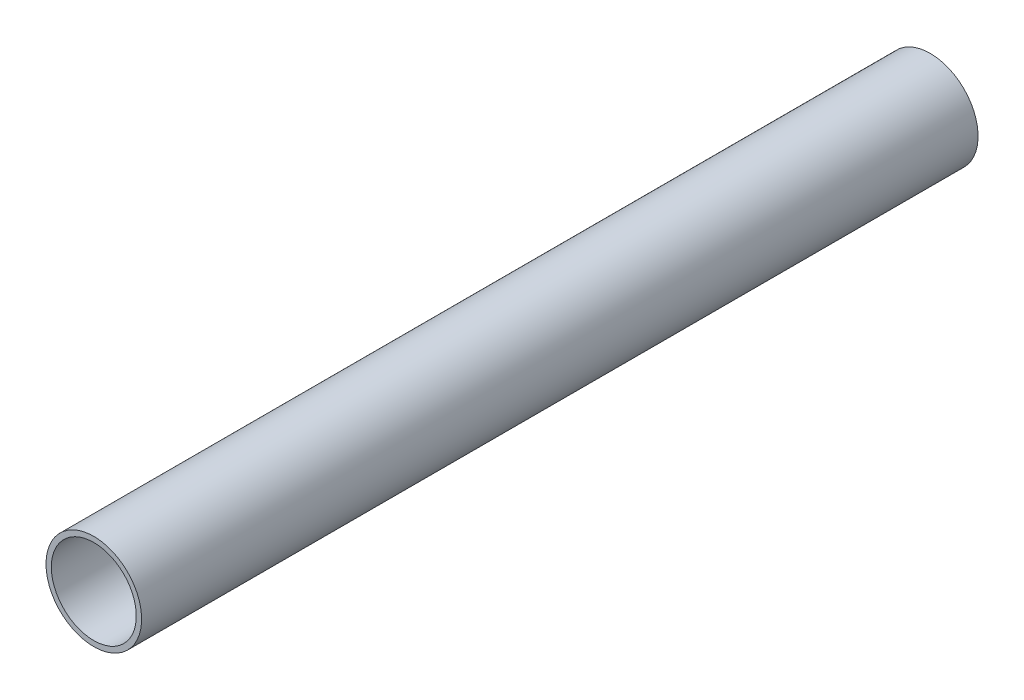
ISO-10303-21;
HEADER;
FILE_DESCRIPTION(('STEP AP214'),'2;1');
FILE_NAME('part.step','',(''),(''),'','','');
FILE_SCHEMA(('AUTOMOTIVE_DESIGN { 1 0 10303 214 1 1 1 1 }'));
ENDSEC;
DATA;
#1=APPLICATION_CONTEXT('core data for automotive mechanical design processes');
#2=APPLICATION_PROTOCOL_DEFINITION('international standard','automotive_design',2000,#1);
#3=PRODUCT_CONTEXT('',#1,'mechanical');
#4=PRODUCT('Part','Part','',(#3));
#5=PRODUCT_RELATED_PRODUCT_CATEGORY('part','',(#4));
#6=PRODUCT_DEFINITION_FORMATION('','',#4);
#7=PRODUCT_DEFINITION_CONTEXT('part definition',#1,'design');
#8=PRODUCT_DEFINITION('design','',#6,#7);
#9=PRODUCT_DEFINITION_SHAPE('','',#8);
#10=(LENGTH_UNIT() NAMED_UNIT(*) SI_UNIT(.MILLI.,.METRE.));
#11=(NAMED_UNIT(*) PLANE_ANGLE_UNIT() SI_UNIT($,.RADIAN.));
#12=(NAMED_UNIT(*) SI_UNIT($,.STERADIAN.) SOLID_ANGLE_UNIT());
#13=UNCERTAINTY_MEASURE_WITH_UNIT(LENGTH_MEASURE(1.E-05),#10,'distance_accuracy_value','');
#14=(GEOMETRIC_REPRESENTATION_CONTEXT(3) GLOBAL_UNCERTAINTY_ASSIGNED_CONTEXT((#13)) GLOBAL_UNIT_ASSIGNED_CONTEXT((#10,
#11,#12)) REPRESENTATION_CONTEXT('',''));
#15=CARTESIAN_POINT('',(0.,0.,0.));
#16=DIRECTION('',(0.,0.,1.));
#17=DIRECTION('',(1.,0.,0.));
#18=AXIS2_PLACEMENT_3D('',#15,#16,#17);
#19=CARTESIAN_POINT('',(0.,0.,475.));
#20=DIRECTION('',(0.,0.,-1.));
#21=DIRECTION('',(-1.,0.,0.));
#22=AXIS2_PLACEMENT_3D('',#19,#20,#21);
#23=CYLINDRICAL_SURFACE('',#22,50.7999999999999);
#24=CARTESIAN_POINT('',(0.,0.,-475.));
#25=DIRECTION('',(0.,0.,-1.));
#26=DIRECTION('',(-1.,0.,0.));
#27=AXIS2_PLACEMENT_3D('',#24,#25,#26);
#28=CIRCLE('',#27,50.8);
#29=CARTESIAN_POINT('',(-50.8,0.,-475.));
#30=VERTEX_POINT('',#29);
#31=EDGE_CURVE('E10',#30,#30,#28,.T.);
#32=ORIENTED_EDGE('',*,*,#31,.T.);
#33=EDGE_LOOP('',(#32));
#34=FACE_BOUND('',#33,.T.);
#35=CARTESIAN_POINT('',(0.,0.,525.));
#36=DIRECTION('',(0.,0.,-1.));
#37=DIRECTION('',(-1.,0.,0.));
#38=AXIS2_PLACEMENT_3D('',#35,#36,#37);
#39=CIRCLE('',#38,50.7999999999999);
#40=CARTESIAN_POINT('',(-50.7999999999999,0.,525.));
#41=VERTEX_POINT('',#40);
#42=EDGE_CURVE('E47',#41,#41,#39,.T.);
#43=ORIENTED_EDGE('',*,*,#42,.F.);
#44=EDGE_LOOP('',(#43));
#45=FACE_BOUND('',#44,.T.);
#46=ADVANCED_FACE('F33',(#34,#45),#23,.F.);
#47=CARTESIAN_POINT('',(50.8,0.,-475.));
#48=DIRECTION('',(0.,0.,-1.));
#49=DIRECTION('',(-1.,0.,0.));
#50=AXIS2_PLACEMENT_3D('',#47,#48,#49);
#51=PLANE('',#50);
#52=CARTESIAN_POINT('',(0.,0.,-475.));
#53=DIRECTION('',(0.,0.,-1.));
#54=DIRECTION('',(-1.,0.,0.));
#55=AXIS2_PLACEMENT_3D('',#52,#53,#54);
#56=CIRCLE('',#55,57.15);
#57=CARTESIAN_POINT('',(-57.15,0.,-475.));
#58=VERTEX_POINT('',#57);
#59=EDGE_CURVE('E39',#58,#58,#56,.T.);
#60=ORIENTED_EDGE('',*,*,#59,.T.);
#61=EDGE_LOOP('',(#60));
#62=FACE_BOUND('',#61,.T.);
#63=ORIENTED_EDGE('',*,*,#31,.F.);
#64=EDGE_LOOP('',(#63));
#65=FACE_BOUND('',#64,.T.);
#66=ADVANCED_FACE('F57',(#62,#65),#51,.T.);
#67=CARTESIAN_POINT('',(0.,0.,475.));
#68=DIRECTION('',(0.,0.,-1.));
#69=DIRECTION('',(-1.,0.,0.));
#70=AXIS2_PLACEMENT_3D('',#67,#68,#69);
#71=CYLINDRICAL_SURFACE('',#70,57.15);
#72=CARTESIAN_POINT('',(0.,0.,525.));
#73=DIRECTION('',(0.,0.,-1.));
#74=DIRECTION('',(-1.,0.,0.));
#75=AXIS2_PLACEMENT_3D('',#72,#73,#74);
#76=CIRCLE('',#75,57.15);
#77=CARTESIAN_POINT('',(-57.15,0.,525.));
#78=VERTEX_POINT('',#77);
#79=EDGE_CURVE('E43',#78,#78,#76,.T.);
#80=ORIENTED_EDGE('',*,*,#79,.T.);
#81=EDGE_LOOP('',(#80));
#82=FACE_BOUND('',#81,.T.);
#83=ORIENTED_EDGE('',*,*,#59,.F.);
#84=EDGE_LOOP('',(#83));
#85=FACE_BOUND('',#84,.T.);
#86=ADVANCED_FACE('F61',(#82,#85),#71,.T.);
#87=CARTESIAN_POINT('',(57.15,0.,525.));
#88=DIRECTION('',(0.,0.,1.));
#89=DIRECTION('',(1.,0.,0.));
#90=AXIS2_PLACEMENT_3D('',#87,#88,#89);
#91=PLANE('',#90);
#92=ORIENTED_EDGE('',*,*,#42,.T.);
#93=EDGE_LOOP('',(#92));
#94=FACE_BOUND('',#93,.T.);
#95=ORIENTED_EDGE('',*,*,#79,.F.);
#96=EDGE_LOOP('',(#95));
#97=FACE_BOUND('',#96,.T.);
#98=ADVANCED_FACE('F53',(#94,#97),#91,.T.);
#99=CLOSED_SHELL('',(#46,#66,#86,#98));
#100=MANIFOLD_SOLID_BREP('B2',#99);
#101=ADVANCED_BREP_SHAPE_REPRESENTATION('',(#18,#100),#14);
#102=SHAPE_DEFINITION_REPRESENTATION(#9,#101);
ENDSEC;
END-ISO-10303-21;
